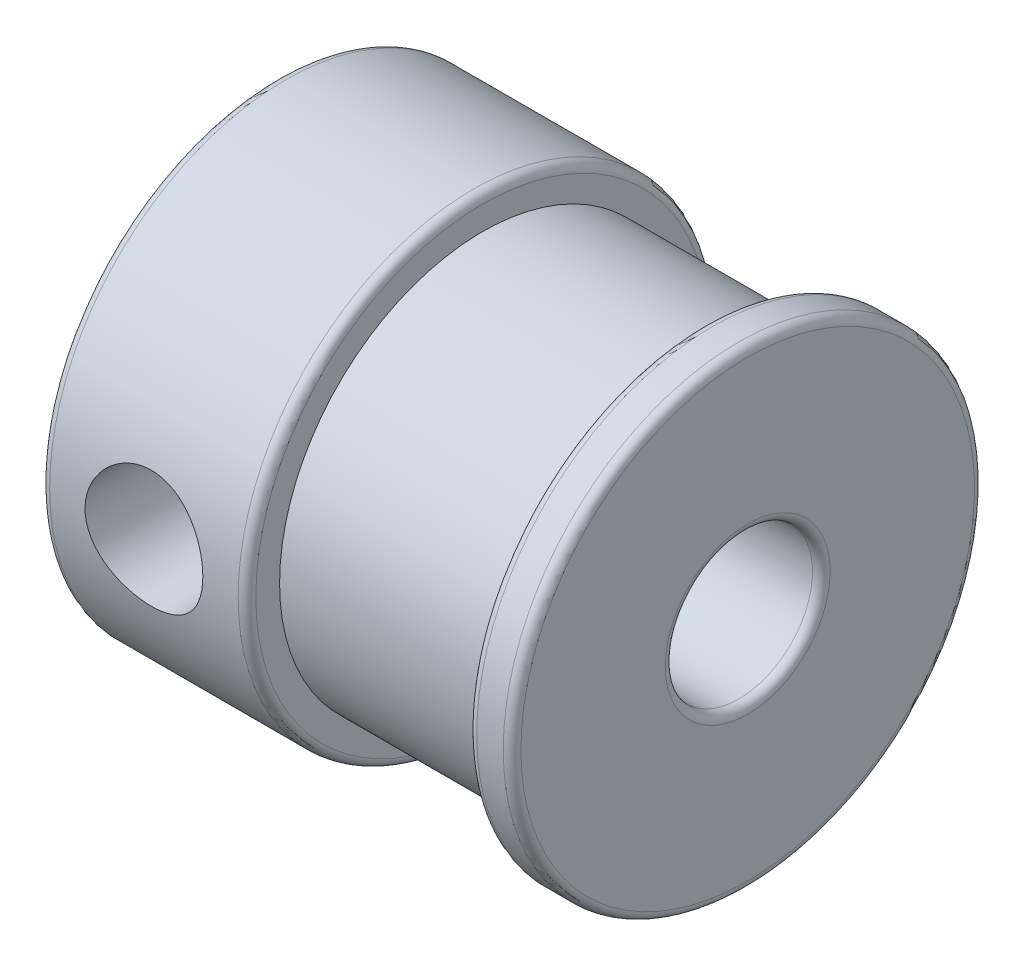
ISO-10303-21;
HEADER;
FILE_DESCRIPTION(('STEP AP214'),'2;1');
FILE_NAME('part.step','',(''),(''),'','','');
FILE_SCHEMA(('AUTOMOTIVE_DESIGN { 1 0 10303 214 1 1 1 1 }'));
ENDSEC;
DATA;
#1=APPLICATION_CONTEXT('core data for automotive mechanical design processes');
#2=APPLICATION_PROTOCOL_DEFINITION('international standard','automotive_design',2000,#1);
#3=PRODUCT_CONTEXT('',#1,'mechanical');
#4=PRODUCT('Part','Part','',(#3));
#5=PRODUCT_RELATED_PRODUCT_CATEGORY('part','',(#4));
#6=PRODUCT_DEFINITION_FORMATION('','',#4);
#7=PRODUCT_DEFINITION_CONTEXT('part definition',#1,'design');
#8=PRODUCT_DEFINITION('design','',#6,#7);
#9=PRODUCT_DEFINITION_SHAPE('','',#8);
#10=(LENGTH_UNIT() NAMED_UNIT(*) SI_UNIT(.MILLI.,.METRE.));
#11=(NAMED_UNIT(*) PLANE_ANGLE_UNIT() SI_UNIT($,.RADIAN.));
#12=(NAMED_UNIT(*) SI_UNIT($,.STERADIAN.) SOLID_ANGLE_UNIT());
#13=UNCERTAINTY_MEASURE_WITH_UNIT(LENGTH_MEASURE(1.E-05),#10,'distance_accuracy_value','');
#14=(GEOMETRIC_REPRESENTATION_CONTEXT(3) GLOBAL_UNCERTAINTY_ASSIGNED_CONTEXT((#13)) GLOBAL_UNIT_ASSIGNED_CONTEXT((#10,
#11,#12)) REPRESENTATION_CONTEXT('',''));
#15=CARTESIAN_POINT('',(0.,0.,0.));
#16=DIRECTION('',(0.,0.,1.));
#17=DIRECTION('',(1.,0.,0.));
#18=AXIS2_PLACEMENT_3D('',#15,#16,#17);
#19=CARTESIAN_POINT('',(0.,0.,0.));
#20=DIRECTION('',(-1.,0.,0.));
#21=DIRECTION('',(0.,0.,1.));
#22=AXIS2_PLACEMENT_3D('',#19,#20,#21);
#23=CYLINDRICAL_SURFACE('',#22,2.5);
#24=CARTESIAN_POINT('',(5.5,0.,2.5));
#25=CARTESIAN_POINT('',(5.49999242056707,0.0959968964388692,2.49999264947401));
#26=CARTESIAN_POINT('',(5.49303057133644,0.192133192964674,2.49441368411908));
#27=CARTESIAN_POINT('',(5.46565005995827,0.381319365477407,2.47259269360604));
#28=CARTESIAN_POINT('',(5.44520162873807,0.474361934321336,2.45632708000382));
#29=CARTESIAN_POINT('',(5.39232172110493,0.654094916824507,2.4146672181517));
#30=CARTESIAN_POINT('',(5.35996664856862,0.740821698128048,2.38933120144167));
#31=CARTESIAN_POINT('',(5.28488265652266,0.906926323692544,2.33136010996601));
#32=CARTESIAN_POINT('',(5.24215370414941,0.986304144671505,2.29872501207752));
#33=CARTESIAN_POINT('',(5.13137163496894,1.16318123656703,2.21575664728952));
#34=CARTESIAN_POINT('',(5.05968108482594,1.25736767952115,2.16321748603216));
#35=CARTESIAN_POINT('',(4.9027219342605,1.43041367827883,2.05292192603027));
#36=CARTESIAN_POINT('',(4.81741424649663,1.50922761533154,1.99515072200505));
#37=CARTESIAN_POINT('',(4.63322601592733,1.6521591895554,1.87856001629835));
#38=CARTESIAN_POINT('',(4.53415322702388,1.71602638457222,1.81973830902028));
#39=CARTESIAN_POINT('',(4.32346121749581,1.82646834413604,1.7088210988299));
#40=CARTESIAN_POINT('',(4.21188566611201,1.87310099386401,1.65670347089169));
#41=CARTESIAN_POINT('',(4.02612104832302,1.93086043771819,1.58835652300928));
#42=CARTESIAN_POINT('',(3.95618826201971,1.94865475820658,1.56628727770189));
#43=CARTESIAN_POINT('',(3.81278731587953,1.97673396798331,1.53069889155832));
#44=CARTESIAN_POINT('',(3.739328326475,1.98703731881776,1.5171587417974));
#45=CARTESIAN_POINT('',(3.58980748112896,1.99939840142554,1.50084234061103));
#46=CARTESIAN_POINT('',(3.5137285151792,2.00138345613423,1.49816096926556));
#47=CARTESIAN_POINT('',(3.36229510796726,1.99669481699685,1.50439962302809));
#48=CARTESIAN_POINT('',(3.2869413342337,1.99001379511087,1.51332946660241));
#49=CARTESIAN_POINT('',(3.12777769738727,1.9669530271194,1.5432072129997));
#50=CARTESIAN_POINT('',(3.044491993946,1.94921808205621,1.56581842049528));
#51=CARTESIAN_POINT('',(2.88346444046296,1.90444547348848,1.61997459936279));
#52=CARTESIAN_POINT('',(2.80573984346018,1.87738025642251,1.65154598198641));
#53=CARTESIAN_POINT('',(2.61933789395902,1.79974102194077,1.73656116159416));
#54=CARTESIAN_POINT('',(2.51419730169581,1.74414886595503,1.79313372968154));
#55=CARTESIAN_POINT('',(2.31628332220066,1.61638467497537,1.90913780060687));
#56=CARTESIAN_POINT('',(2.22352827915646,1.54418846902464,1.96857337048937));
#57=CARTESIAN_POINT('',(2.04872522859492,1.38145818326396,2.08612751968448));
#58=CARTESIAN_POINT('',(1.96702807769423,1.29048701026967,2.14416889260779));
#59=CARTESIAN_POINT('',(1.81990050056569,1.09198491072666,2.25171871494995));
#60=CARTESIAN_POINT('',(1.75442648388277,0.984499645201077,2.30124991822451));
#61=CARTESIAN_POINT('',(1.6594371525901,0.787777814380557,2.37424585643318));
#62=CARTESIAN_POINT('',(1.62499549556093,0.702177727329204,2.40111071224172));
#63=CARTESIAN_POINT('',(1.56787354901203,0.524913923737151,2.44597564111417));
#64=CARTESIAN_POINT('',(1.54518439505452,0.433254836272282,2.46398239496913));
#65=CARTESIAN_POINT('',(1.51286145306421,0.245713233844926,2.48970335685206));
#66=CARTESIAN_POINT('',(1.50329587525504,0.149811307212615,2.49736378633667));
#67=CARTESIAN_POINT('',(1.49814095102371,-0.0426080028675194,2.50148682701864));
#68=CARTESIAN_POINT('',(1.50254900117794,-0.139125268327964,2.49795152409062));
#69=CARTESIAN_POINT('',(1.52408281624768,-0.321746674155464,2.48076858642945));
#70=CARTESIAN_POINT('',(1.54014917513901,-0.408060891756567,2.46796352405063));
#71=CARTESIAN_POINT('',(1.58287218110156,-0.576335674228723,2.43417513213473));
#72=CARTESIAN_POINT('',(1.60953197109662,-0.658294938856942,2.41318937553439));
#73=CARTESIAN_POINT('',(1.67415037178393,-0.821235877548911,2.36289849431328));
#74=CARTESIAN_POINT('',(1.71270578595636,-0.901843619419055,2.33315912736867));
#75=CARTESIAN_POINT('',(1.79886215163279,-1.05541000448331,2.2678362272214));
#76=CARTESIAN_POINT('',(1.84646355423455,-1.12836826593788,2.23225240258423));
#77=CARTESIAN_POINT('',(1.95922431829687,-1.27925237569143,2.14993687522397));
#78=CARTESIAN_POINT('',(2.026001690483,-1.35550718978129,2.1023696976822));
#79=CARTESIAN_POINT('',(2.16938696137099,-1.4965368759753,2.0044349795202));
#80=CARTESIAN_POINT('',(2.24602283683883,-1.56127777727367,1.95405970991097));
#81=CARTESIAN_POINT('',(2.37643444323659,-1.65568487930787,1.87374135317135));
#82=CARTESIAN_POINT('',(2.42736059075333,-1.68913741792652,1.84354743685463));
#83=CARTESIAN_POINT('',(2.53262226142359,-1.75155001920544,1.78435415521131));
#84=CARTESIAN_POINT('',(2.58695957188079,-1.78050769868976,1.75535542951891));
#85=CARTESIAN_POINT('',(2.69887484028166,-1.83358089959817,1.69983828792997));
#86=CARTESIAN_POINT('',(2.75643976724369,-1.85771431687655,1.67331090774834));
#87=CARTESIAN_POINT('',(2.87500897850399,-1.90088481958635,1.62410209867689));
#88=CARTESIAN_POINT('',(2.93601073751954,-1.9199255893155,1.60141789380427));
#89=CARTESIAN_POINT('',(3.0660867242378,-1.95360165889083,1.5601942022258));
#90=CARTESIAN_POINT('',(3.13542266494035,-1.96779559724999,1.54209716714775));
#91=CARTESIAN_POINT('',(3.27683761273806,-1.98878905619367,1.51493371593791));
#92=CARTESIAN_POINT('',(3.34890922045049,-1.99560723074758,1.50584452307525));
#93=CARTESIAN_POINT('',(3.49434870546408,-2.00132058716546,1.49824736779721));
#94=CARTESIAN_POINT('',(3.56772145415416,-2.0001731977979,1.49979625918437));
#95=CARTESIAN_POINT('',(3.71298419302311,-1.98996519544204,1.51330771695992));
#96=CARTESIAN_POINT('',(3.7848716473261,-1.98089203653787,1.52528679347387));
#97=CARTESIAN_POINT('',(3.94460677434456,-1.95207745752715,1.56207076756083));
#98=CARTESIAN_POINT('',(4.03142308249112,-1.93009230408642,1.5894925841937));
#99=CARTESIAN_POINT('',(4.19863347868964,-1.87608177217432,1.65288907642407));
#100=CARTESIAN_POINT('',(4.27900776003672,-1.84402681542564,1.68888887211293));
#101=CARTESIAN_POINT('',(4.41217772204616,-1.78094746311468,1.75491158724439));
#102=CARTESIAN_POINT('',(4.46651918151829,-1.75202363190409,1.78388907325008));
#103=CARTESIAN_POINT('',(4.57183822981726,-1.68964733782463,1.84307948739002));
#104=CARTESIAN_POINT('',(4.62281458495115,-1.65619322765903,1.87329286211509));
#105=CARTESIAN_POINT('',(4.77077940329882,-1.54918435570711,1.9643799775812));
#106=CARTESIAN_POINT('',(4.86279868666248,-1.46898541640509,2.02569808481402));
#107=CARTESIAN_POINT('',(5.03338946483077,-1.29001718858431,2.14418278787113));
#108=CARTESIAN_POINT('',(5.11177022423679,-1.19101966157648,2.20128491964101));
#109=CARTESIAN_POINT('',(5.21557672941679,-1.02998399899547,2.27874650804527));
#110=CARTESIAN_POINT('',(5.24786844413512,-0.974255400199692,2.30318868109329));
#111=CARTESIAN_POINT('',(5.30736810096139,-0.858854828628041,2.34866115465602));
#112=CARTESIAN_POINT('',(5.33457915448451,-0.799185299805359,2.36969354228912));
#113=CARTESIAN_POINT('',(5.39178005989561,-0.655037739424243,2.41420905511499));
#114=CARTESIAN_POINT('',(5.41948267180093,-0.569110239590115,2.43602892887628));
#115=CARTESIAN_POINT('',(5.46315767338771,-0.392713097427717,2.47058864976841));
#116=CARTESIAN_POINT('',(5.4791607887746,-0.302256024103133,2.48335227816872));
#117=CARTESIAN_POINT('',(5.49256302556031,-0.175880930919907,2.49405378309104));
#118=CARTESIAN_POINT('',(5.49534737874577,-0.140808552821268,2.4962791876343));
#119=CARTESIAN_POINT('',(5.49906746352746,-0.0704970748918255,2.499253810179));
#120=CARTESIAN_POINT('',(5.50000278378989,-0.0352579397117329,2.50000269971647));
#121=CARTESIAN_POINT('',(5.5,0.,2.5));
#122=B_SPLINE_CURVE_WITH_KNOTS('',3,(#24,#25,#26,#27,#28,#29,#30,#31,#32,#33,#34,#35,#36,#37,
#38,#39,#40,#41,#42,#43,#44,#45,#46,#47,#48,#49,#50,#51,#52,#53,#54,#55,#56,#57,#58,#59,#60,#61,
#62,#63,#64,#65,#66,#67,#68,#69,#70,#71,#72,#73,#74,#75,#76,#77,#78,#79,#80,#81,#82,#83,#84,#85,
#86,#87,#88,#89,#90,#91,#92,#93,#94,#95,#96,#97,#98,#99,#100,#101,#102,#103,#104,#105,#106,#107,
#108,#109,#110,#111,#112,#113,#114,#115,#116,#117,#118,#119,#120,#121),.UNSPECIFIED.,.T.,.F.,(4,
2,2,2,2,2,2,2,2,2,2,2,2,2,2,2,2,2,2,2,2,2,2,2,2,2,2,2,2,2,2,2,2,2,2,2,2,2,2,2,2,2,2,2,2,2,2,2,
4),(0.,0.287836605992209,0.576310692639343,0.862965057250605,1.14962032997081,1.53607888200101,
1.92366738187851,2.31734741765481,2.70969292925127,2.9353448634113,3.16043877408111,
3.38749528500759,3.61474392028823,3.87758630032011,4.14121163495706,4.53425748188301,
4.92787915886674,5.33198173288419,5.73498644040677,6.02213978124802,6.30907621738868,
6.59749843639965,6.88586692268771,7.15087004938159,7.41595185759573,7.69742753051566,
7.9789172435135,8.31365537249325,8.64936529970902,8.85316560745906,9.05707360380851,
9.26021055202079,9.46320013996582,9.68152133432596,9.89928907450684,10.1182215471168,
10.3375012031536,10.616933053181,10.8971934831173,11.1010640012511,11.3050088506911,
11.7129165318148,12.1261363563906,12.3324811048119,12.5386990694968,12.8161540735935,
13.0928777702216,13.1985714874516,13.3042887145431),.UNSPECIFIED.);
#123=CARTESIAN_POINT('',(5.5,0.,2.5));
#124=VERTEX_POINT('',#123);
#125=EDGE_CURVE('E90',#124,#124,#122,.T.);
#126=ORIENTED_EDGE('',*,*,#125,.T.);
#127=EDGE_LOOP('',(#126));
#128=FACE_BOUND('',#127,.T.);
#129=CARTESIAN_POINT('',(5.5,0.,-2.5));
#130=CARTESIAN_POINT('',(5.49999242056707,-0.0959968964388692,-2.49999264947401));
#131=CARTESIAN_POINT('',(5.49303057133644,-0.192133192964674,-2.49441368411908));
#132=CARTESIAN_POINT('',(5.46565005995827,-0.381319365477407,-2.47259269360604));
#133=CARTESIAN_POINT('',(5.44520162873807,-0.474361934321336,-2.45632708000382));
#134=CARTESIAN_POINT('',(5.39232172110493,-0.654094916824507,-2.4146672181517));
#135=CARTESIAN_POINT('',(5.35996664856862,-0.740821698128048,-2.38933120144167));
#136=CARTESIAN_POINT('',(5.28488265652266,-0.906926323692544,-2.33136010996601));
#137=CARTESIAN_POINT('',(5.24215370414941,-0.986304144671505,-2.29872501207752));
#138=CARTESIAN_POINT('',(5.13137163496894,-1.16318123656703,-2.21575664728952));
#139=CARTESIAN_POINT('',(5.05968108482594,-1.25736767952115,-2.16321748603216));
#140=CARTESIAN_POINT('',(4.9027219342605,-1.43041367827883,-2.05292192603027));
#141=CARTESIAN_POINT('',(4.81741424649663,-1.50922761533154,-1.99515072200505));
#142=CARTESIAN_POINT('',(4.63322601592733,-1.6521591895554,-1.87856001629835));
#143=CARTESIAN_POINT('',(4.53415322702388,-1.71602638457222,-1.81973830902028));
#144=CARTESIAN_POINT('',(4.32346121749581,-1.82646834413604,-1.7088210988299));
#145=CARTESIAN_POINT('',(4.21188566611201,-1.87310099386401,-1.65670347089169));
#146=CARTESIAN_POINT('',(4.02612104832302,-1.93086043771819,-1.58835652300928));
#147=CARTESIAN_POINT('',(3.95618826201971,-1.94865475820658,-1.56628727770189));
#148=CARTESIAN_POINT('',(3.81278731587953,-1.97673396798331,-1.53069889155832));
#149=CARTESIAN_POINT('',(3.739328326475,-1.98703731881776,-1.5171587417974));
#150=CARTESIAN_POINT('',(3.58980748112896,-1.99939840142554,-1.50084234061103));
#151=CARTESIAN_POINT('',(3.5137285151792,-2.00138345613423,-1.49816096926556));
#152=CARTESIAN_POINT('',(3.36229510796726,-1.99669481699685,-1.50439962302809));
#153=CARTESIAN_POINT('',(3.2869413342337,-1.99001379511087,-1.51332946660241));
#154=CARTESIAN_POINT('',(3.12777769738727,-1.9669530271194,-1.5432072129997));
#155=CARTESIAN_POINT('',(3.044491993946,-1.94921808205621,-1.56581842049528));
#156=CARTESIAN_POINT('',(2.88346444046296,-1.90444547348848,-1.61997459936279));
#157=CARTESIAN_POINT('',(2.80573984346018,-1.87738025642251,-1.65154598198641));
#158=CARTESIAN_POINT('',(2.61933789395902,-1.79974102194077,-1.73656116159416));
#159=CARTESIAN_POINT('',(2.51419730169581,-1.74414886595503,-1.79313372968154));
#160=CARTESIAN_POINT('',(2.31628332220066,-1.61638467497537,-1.90913780060687));
#161=CARTESIAN_POINT('',(2.22352827915646,-1.54418846902464,-1.96857337048937));
#162=CARTESIAN_POINT('',(2.04872522859492,-1.38145818326396,-2.08612751968448));
#163=CARTESIAN_POINT('',(1.96702807769423,-1.29048701026967,-2.14416889260779));
#164=CARTESIAN_POINT('',(1.81990050056569,-1.09198491072666,-2.25171871494995));
#165=CARTESIAN_POINT('',(1.75442648388277,-0.984499645201077,-2.30124991822451));
#166=CARTESIAN_POINT('',(1.6594371525901,-0.787777814380557,-2.37424585643318));
#167=CARTESIAN_POINT('',(1.62499549556093,-0.702177727329204,-2.40111071224172));
#168=CARTESIAN_POINT('',(1.56787354901203,-0.524913923737151,-2.44597564111417));
#169=CARTESIAN_POINT('',(1.54518439505452,-0.433254836272282,-2.46398239496913));
#170=CARTESIAN_POINT('',(1.51286145306421,-0.245713233844926,-2.48970335685206));
#171=CARTESIAN_POINT('',(1.50329587525504,-0.149811307212615,-2.49736378633667));
#172=CARTESIAN_POINT('',(1.49814095102371,0.0426080028675194,-2.50148682701864));
#173=CARTESIAN_POINT('',(1.50254900117794,0.139125268327964,-2.49795152409062));
#174=CARTESIAN_POINT('',(1.52408281624768,0.321746674155464,-2.48076858642945));
#175=CARTESIAN_POINT('',(1.54014917513901,0.408060891756567,-2.46796352405063));
#176=CARTESIAN_POINT('',(1.58287218110156,0.576335674228723,-2.43417513213473));
#177=CARTESIAN_POINT('',(1.60953197109662,0.658294938856942,-2.41318937553439));
#178=CARTESIAN_POINT('',(1.67415037178393,0.821235877548911,-2.36289849431328));
#179=CARTESIAN_POINT('',(1.71270578595636,0.901843619419055,-2.33315912736867));
#180=CARTESIAN_POINT('',(1.79886215163279,1.05541000448331,-2.2678362272214));
#181=CARTESIAN_POINT('',(1.84646355423455,1.12836826593788,-2.23225240258423));
#182=CARTESIAN_POINT('',(1.95922431829687,1.27925237569143,-2.14993687522397));
#183=CARTESIAN_POINT('',(2.026001690483,1.35550718978129,-2.1023696976822));
#184=CARTESIAN_POINT('',(2.16938696137099,1.4965368759753,-2.0044349795202));
#185=CARTESIAN_POINT('',(2.24602283683883,1.56127777727367,-1.95405970991097));
#186=CARTESIAN_POINT('',(2.37643444323659,1.65568487930787,-1.87374135317135));
#187=CARTESIAN_POINT('',(2.42736059075333,1.68913741792652,-1.84354743685463));
#188=CARTESIAN_POINT('',(2.53262226142359,1.75155001920544,-1.78435415521131));
#189=CARTESIAN_POINT('',(2.58695957188079,1.78050769868976,-1.75535542951891));
#190=CARTESIAN_POINT('',(2.69887484028166,1.83358089959817,-1.69983828792997));
#191=CARTESIAN_POINT('',(2.75643976724369,1.85771431687655,-1.67331090774834));
#192=CARTESIAN_POINT('',(2.87500897850399,1.90088481958635,-1.62410209867689));
#193=CARTESIAN_POINT('',(2.93601073751954,1.9199255893155,-1.60141789380427));
#194=CARTESIAN_POINT('',(3.0660867242378,1.95360165889083,-1.5601942022258));
#195=CARTESIAN_POINT('',(3.13542266494035,1.96779559724999,-1.54209716714775));
#196=CARTESIAN_POINT('',(3.27683761273806,1.98878905619367,-1.51493371593791));
#197=CARTESIAN_POINT('',(3.34890922045049,1.99560723074758,-1.50584452307525));
#198=CARTESIAN_POINT('',(3.49434870546408,2.00132058716546,-1.49824736779721));
#199=CARTESIAN_POINT('',(3.56772145415416,2.0001731977979,-1.49979625918437));
#200=CARTESIAN_POINT('',(3.71298419302311,1.98996519544204,-1.51330771695992));
#201=CARTESIAN_POINT('',(3.7848716473261,1.98089203653787,-1.52528679347387));
#202=CARTESIAN_POINT('',(3.94460677434456,1.95207745752715,-1.56207076756083));
#203=CARTESIAN_POINT('',(4.03142308249112,1.93009230408642,-1.5894925841937));
#204=CARTESIAN_POINT('',(4.19863347868964,1.87608177217432,-1.65288907642407));
#205=CARTESIAN_POINT('',(4.27900776003672,1.84402681542564,-1.68888887211293));
#206=CARTESIAN_POINT('',(4.41217772204616,1.78094746311468,-1.75491158724439));
#207=CARTESIAN_POINT('',(4.46651918151829,1.75202363190409,-1.78388907325008));
#208=CARTESIAN_POINT('',(4.57183822981726,1.68964733782463,-1.84307948739002));
#209=CARTESIAN_POINT('',(4.62281458495115,1.65619322765903,-1.87329286211509));
#210=CARTESIAN_POINT('',(4.77077940329882,1.54918435570711,-1.9643799775812));
#211=CARTESIAN_POINT('',(4.86279868666248,1.46898541640509,-2.02569808481402));
#212=CARTESIAN_POINT('',(5.03338946483077,1.29001718858431,-2.14418278787113));
#213=CARTESIAN_POINT('',(5.11177022423679,1.19101966157648,-2.20128491964101));
#214=CARTESIAN_POINT('',(5.21557672941679,1.02998399899547,-2.27874650804527));
#215=CARTESIAN_POINT('',(5.24786844413512,0.974255400199692,-2.30318868109329));
#216=CARTESIAN_POINT('',(5.30736810096139,0.858854828628041,-2.34866115465602));
#217=CARTESIAN_POINT('',(5.33457915448451,0.799185299805359,-2.36969354228912));
#218=CARTESIAN_POINT('',(5.39178005989561,0.655037739424243,-2.41420905511499));
#219=CARTESIAN_POINT('',(5.41948267180093,0.569110239590115,-2.43602892887628));
#220=CARTESIAN_POINT('',(5.46315767338771,0.392713097427717,-2.47058864976841));
#221=CARTESIAN_POINT('',(5.4791607887746,0.302256024103133,-2.48335227816872));
#222=CARTESIAN_POINT('',(5.49256302556031,0.175880930919907,-2.49405378309104));
#223=CARTESIAN_POINT('',(5.49534737874577,0.140808552821268,-2.4962791876343));
#224=CARTESIAN_POINT('',(5.49906746352746,0.0704970748918255,-2.499253810179));
#225=CARTESIAN_POINT('',(5.50000278378989,0.0352579397117329,-2.50000269971647));
#226=CARTESIAN_POINT('',(5.5,0.,-2.5));
#227=B_SPLINE_CURVE_WITH_KNOTS('',3,(#129,#130,#131,#132,#133,#134,#135,#136,#137,#138,#139,
#140,#141,#142,#143,#144,#145,#146,#147,#148,#149,#150,#151,#152,#153,#154,#155,#156,#157,#158,
#159,#160,#161,#162,#163,#164,#165,#166,#167,#168,#169,#170,#171,#172,#173,#174,#175,#176,#177,
#178,#179,#180,#181,#182,#183,#184,#185,#186,#187,#188,#189,#190,#191,#192,#193,#194,#195,#196,
#197,#198,#199,#200,#201,#202,#203,#204,#205,#206,#207,#208,#209,#210,#211,#212,#213,#214,#215,
#216,#217,#218,#219,#220,#221,#222,#223,#224,#225,#226),.UNSPECIFIED.,.T.,.F.,(4,2,2,2,2,2,2,2,
2,2,2,2,2,2,2,2,2,2,2,2,2,2,2,2,2,2,2,2,2,2,2,2,2,2,2,2,2,2,2,2,2,2,2,2,2,2,2,2,4),(0.,
0.287836605992209,0.576310692639343,0.862965057250605,1.14962032997081,1.53607888200101,
1.92366738187851,2.31734741765481,2.70969292925127,2.9353448634113,3.16043877408111,
3.38749528500759,3.61474392028823,3.87758630032011,4.14121163495706,4.53425748188301,
4.92787915886674,5.33198173288419,5.73498644040677,6.02213978124802,6.30907621738868,
6.59749843639965,6.88586692268771,7.15087004938159,7.41595185759573,7.69742753051566,
7.9789172435135,8.31365537249325,8.64936529970902,8.85316560745906,9.05707360380851,
9.26021055202079,9.46320013996582,9.68152133432596,9.89928907450684,10.1182215471168,
10.3375012031536,10.616933053181,10.8971934831173,11.1010640012511,11.3050088506911,
11.7129165318148,12.1261363563906,12.3324811048119,12.5386990694968,12.8161540735935,
13.0928777702216,13.1985714874516,13.3042887145431),.UNSPECIFIED.);
#228=CARTESIAN_POINT('',(5.5,0.,-2.5));
#229=VERTEX_POINT('',#228);
#230=EDGE_CURVE('E83',#229,#229,#227,.T.);
#231=ORIENTED_EDGE('',*,*,#230,.T.);
#232=EDGE_LOOP('',(#231));
#233=FACE_BOUND('',#232,.T.);
#234=CARTESIAN_POINT('',(0.3,0.,0.));
#235=DIRECTION('',(1.,0.,0.));
#236=DIRECTION('',(0.,0.,-1.));
#237=AXIS2_PLACEMENT_3D('',#234,#235,#236);
#238=CIRCLE('',#237,2.5);
#239=CARTESIAN_POINT('',(0.3,0.,-2.5));
#240=VERTEX_POINT('',#239);
#241=EDGE_CURVE('E162',#240,#240,#238,.F.);
#242=ORIENTED_EDGE('',*,*,#241,.T.);
#243=EDGE_LOOP('',(#242));
#244=FACE_BOUND('',#243,.T.);
#245=CARTESIAN_POINT('',(15.7,0.,0.));
#246=DIRECTION('',(-1.,0.,0.));
#247=DIRECTION('',(0.,0.,1.));
#248=AXIS2_PLACEMENT_3D('',#245,#246,#247);
#249=CIRCLE('',#248,2.5);
#250=CARTESIAN_POINT('',(15.7,0.,2.5));
#251=VERTEX_POINT('',#250);
#252=EDGE_CURVE('E166',#251,#251,#249,.F.);
#253=ORIENTED_EDGE('',*,*,#252,.T.);
#254=EDGE_LOOP('',(#253));
#255=FACE_BOUND('',#254,.T.);
#256=ADVANCED_FACE('F37',(#128,#233,#244,#255),#23,.F.);
#257=CARTESIAN_POINT('',(0.,0.,-2.5));
#258=DIRECTION('',(1.,0.,0.));
#259=DIRECTION('',(0.,0.,-1.));
#260=AXIS2_PLACEMENT_3D('',#257,#258,#259);
#261=PLANE('',#260);
#262=CARTESIAN_POINT('',(0.,0.,0.));
#263=DIRECTION('',(1.,0.,0.));
#264=DIRECTION('',(0.,0.,-1.));
#265=AXIS2_PLACEMENT_3D('',#262,#263,#264);
#266=CIRCLE('',#265,2.8);
#267=CARTESIAN_POINT('',(0.,0.,-2.8));
#268=VERTEX_POINT('',#267);
#269=EDGE_CURVE('E154',#268,#268,#266,.T.);
#270=ORIENTED_EDGE('',*,*,#269,.T.);
#271=EDGE_LOOP('',(#270));
#272=FACE_BOUND('',#271,.T.);
#273=CARTESIAN_POINT('',(0.,0.,0.));
#274=DIRECTION('',(1.,0.,0.));
#275=DIRECTION('',(0.,0.,-1.));
#276=AXIS2_PLACEMENT_3D('',#273,#274,#275);
#277=CIRCLE('',#276,7.7);
#278=CARTESIAN_POINT('',(0.,0.,-7.7));
#279=VERTEX_POINT('',#278);
#280=EDGE_CURVE('E158',#279,#279,#277,.F.);
#281=ORIENTED_EDGE('',*,*,#280,.T.);
#282=EDGE_LOOP('',(#281));
#283=FACE_BOUND('',#282,.T.);
#284=ADVANCED_FACE('F98',(#272,#283),#261,.F.);
#285=CARTESIAN_POINT('',(0.,0.,0.));
#286=DIRECTION('',(-1.,0.,0.));
#287=DIRECTION('',(0.,0.,1.));
#288=AXIS2_PLACEMENT_3D('',#285,#286,#287);
#289=CYLINDRICAL_SURFACE('',#288,8.);
#290=CARTESIAN_POINT('',(5.5,0.,-8.));
#291=CARTESIAN_POINT('',(5.49999689901579,0.110501451559641,-7.9999981315735));
#292=CARTESIAN_POINT('',(5.49081126563495,0.221037543774351,-7.99768770842435));
#293=CARTESIAN_POINT('',(5.45436646492399,0.438941765027377,-7.98869485106526));
#294=CARTESIAN_POINT('',(5.42709705394953,0.546308062494319,-7.98200993893301));
#295=CARTESIAN_POINT('',(5.35541432871722,0.754694496243436,-7.96500835109376));
#296=CARTESIAN_POINT('',(5.31102160171298,0.855722084573336,-7.95469603789411));
#297=CARTESIAN_POINT('',(5.20642481327354,1.04889617587257,-7.93153791743495));
#298=CARTESIAN_POINT('',(5.14622021850804,1.14104237913168,-7.91869202472209));
#299=CARTESIAN_POINT('',(5.01039894712776,1.31573590306789,-7.89156551455591));
#300=CARTESIAN_POINT('',(4.93451790005459,1.39807425341474,-7.87726276197502));
#301=CARTESIAN_POINT('',(4.77006372678795,1.54899856960443,-7.84898160157248));
#302=CARTESIAN_POINT('',(4.68148916940409,1.61758298259892,-7.83500323053157));
#303=CARTESIAN_POINT('',(4.49253969768401,1.74003539039863,-7.80873034264225));
#304=CARTESIAN_POINT('',(4.39200902558836,1.79366962123352,-7.79646392619748));
#305=CARTESIAN_POINT('',(4.18300211778662,1.88319587806766,-7.77532659757355));
#306=CARTESIAN_POINT('',(4.07452715555731,1.91909074058685,-7.76645514259225));
#307=CARTESIAN_POINT('',(3.85500866906445,1.97140644907302,-7.7533396892843));
#308=CARTESIAN_POINT('',(3.74406013861601,1.98820302444274,-7.74900654662681));
#309=CARTESIAN_POINT('',(3.52084190800087,2.00301570008854,-7.74519149946122));
#310=CARTESIAN_POINT('',(3.40857242574382,2.00103485575748,-7.74570880570571));
#311=CARTESIAN_POINT('',(3.1887789230062,1.97864869951961,-7.75145607355756));
#312=CARTESIAN_POINT('',(3.08120583804623,1.95869112025418,-7.75657150676391));
#313=CARTESIAN_POINT('',(2.87098526545192,1.90163224920399,-7.77075612894758));
#314=CARTESIAN_POINT('',(2.76833812929477,1.86452973609252,-7.77982559958985));
#315=CARTESIAN_POINT('',(2.56968264499716,1.77385263724958,-7.80100151874212));
#316=CARTESIAN_POINT('',(2.47375177094724,1.72011555631056,-7.81313769959755));
#317=CARTESIAN_POINT('',(2.29210838699091,1.59780836801993,-7.83906281127988));
#318=CARTESIAN_POINT('',(2.20639766924367,1.52923566507845,-7.85285203112837));
#319=CARTESIAN_POINT('',(2.04506184574079,1.37688456624163,-7.88101174053188));
#320=CARTESIAN_POINT('',(1.96979401325153,1.29272834422115,-7.89538759304001));
#321=CARTESIAN_POINT('',(1.8343716767148,1.11281589000493,-7.92274620771675));
#322=CARTESIAN_POINT('',(1.77421763431525,1.01705930361059,-7.93572892732543));
#323=CARTESIAN_POINT('',(1.67059921836749,0.816154518241856,-7.9589030945892));
#324=CARTESIAN_POINT('',(1.62719287966076,0.710975190944832,-7.96908480170303));
#325=CARTESIAN_POINT('',(1.55877692572057,0.494501344190511,-7.98543889321888));
#326=CARTESIAN_POINT('',(1.53376379144248,0.383207998867313,-7.99161204452374));
#327=CARTESIAN_POINT('',(1.50338991258822,0.160719960520036,-7.999139990285));
#328=CARTESIAN_POINT('',(1.4975426318996,0.0495956266509467,-8.00061404677705));
#329=CARTESIAN_POINT('',(1.50433200274065,-0.172043833068677,-7.99891739752601));
#330=CARTESIAN_POINT('',(1.51696699039884,-0.28255901285946,-7.99574710989128));
#331=CARTESIAN_POINT('',(1.55996121118851,-0.498152358368655,-7.98519441503143));
#332=CARTESIAN_POINT('',(1.59005501796932,-0.603286825291672,-7.97787512247748));
#333=CARTESIAN_POINT('',(1.66680944537126,-0.807009723270015,-7.95984942178845));
#334=CARTESIAN_POINT('',(1.71347173908423,-0.905597492043513,-7.94914267159856));
#335=CARTESIAN_POINT('',(1.8229815051663,-1.0953641792398,-7.92524410568414));
#336=CARTESIAN_POINT('',(1.88610148319568,-1.18638058911444,-7.91201156489243));
#337=CARTESIAN_POINT('',(2.02638654506263,-1.35670215152433,-7.88459345583226));
#338=CARTESIAN_POINT('',(2.10355405282254,-1.43600527863068,-7.87040772335606));
#339=CARTESIAN_POINT('',(2.27200261445929,-1.58265409076364,-7.84225275947695));
#340=CARTESIAN_POINT('',(2.36358360400323,-1.64965849016271,-7.82829738916375));
#341=CARTESIAN_POINT('',(2.55697684595429,-1.7673476786836,-7.80257171169652));
#342=CARTESIAN_POINT('',(2.65878864394634,-1.81803319221058,-7.79080130756035));
#343=CARTESIAN_POINT('',(2.8692076298841,-1.90126856081239,-7.77090792979553));
#344=CARTESIAN_POINT('',(2.97777017112535,-1.93392586220542,-7.76276340389207));
#345=CARTESIAN_POINT('',(3.19907951718548,-1.98046087993837,-7.75102325453578));
#346=CARTESIAN_POINT('',(3.31182540137665,-1.99434270330488,-7.74742663626581));
#347=CARTESIAN_POINT('',(3.53482803180694,-2.00271812044533,-7.74526534938609));
#348=CARTESIAN_POINT('',(3.64506324683297,-1.99775719704016,-7.74655910304352));
#349=CARTESIAN_POINT('',(3.86307185155731,-1.96983637108382,-7.7537054534379));
#350=CARTESIAN_POINT('',(3.97084529068487,-1.94687683024903,-7.75955795855809));
#351=CARTESIAN_POINT('',(4.18027794542055,-1.88390842592373,-7.77508347576963));
#352=CARTESIAN_POINT('',(4.28196974032028,-1.84400187290717,-7.78473353648412));
#353=CARTESIAN_POINT('',(4.47728717695159,-1.74835321814009,-7.80677007633105));
#354=CARTESIAN_POINT('',(4.57091169758255,-1.69260892004559,-7.81915693494364));
#355=CARTESIAN_POINT('',(4.75007283866936,-1.56515699818285,-7.84567512351349));
#356=CARTESIAN_POINT('',(4.83533476456528,-1.49307088388301,-7.85984353109009));
#357=CARTESIAN_POINT('',(4.99272939306054,-1.33571916158631,-7.88810702995048));
#358=CARTESIAN_POINT('',(5.06485897348396,-1.25045042834819,-7.90220210302746));
#359=CARTESIAN_POINT('',(5.19521507808614,-1.06729011560345,-7.92903540863551));
#360=CARTESIAN_POINT('',(5.25316615156211,-0.969197896421849,-7.94174444487824));
#361=CARTESIAN_POINT('',(5.35166328392071,-0.764354746013968,-7.96406566633491));
#362=CARTESIAN_POINT('',(5.39222181419805,-0.657610084582319,-7.97368006933042));
#363=CARTESIAN_POINT('',(5.44876244043954,-0.459213670991296,-7.98730746087389));
#364=CARTESIAN_POINT('',(5.46793499073791,-0.368506894544092,-7.9920344673692));
#365=CARTESIAN_POINT('',(5.49355459149592,-0.185208095381711,-7.99838140309264));
#366=CARTESIAN_POINT('',(5.50000259907374,-0.0926162149901553,-8.00000156601192));
#367=CARTESIAN_POINT('',(5.5,0.,-8.));
#368=B_SPLINE_CURVE_WITH_KNOTS('',3,(#290,#291,#292,#293,#294,#295,#296,#297,#298,#299,#300,
#301,#302,#303,#304,#305,#306,#307,#308,#309,#310,#311,#312,#313,#314,#315,#316,#317,#318,#319,
#320,#321,#322,#323,#324,#325,#326,#327,#328,#329,#330,#331,#332,#333,#334,#335,#336,#337,#338,
#339,#340,#341,#342,#343,#344,#345,#346,#347,#348,#349,#350,#351,#352,#353,#354,#355,#356,#357,
#358,#359,#360,#361,#362,#363,#364,#365,#366,#367),.UNSPECIFIED.,.T.,.F.,(4,2,2,2,2,2,2,2,2,2,2,
2,2,2,2,2,2,2,2,2,2,2,2,2,2,2,2,2,2,2,2,2,2,2,2,2,2,2,4),(0.,0.33116494996252,0.662517650351866,
0.993473203048141,1.32443992022577,1.66152580582852,1.99864972773416,2.34078196727743,
2.68285948225825,3.01808393468093,3.3532538415469,3.68029996013785,4.00736937959146,
4.337740371696,4.66816921119311,5.00802001296453,5.34788119415424,5.6889097201658,
6.02987298255951,6.36211078603463,6.69431868154751,7.02160366023144,7.34892169767481,
7.68204783424897,8.01523150681786,8.35659345610396,8.69794025003772,9.03723006156476,
9.37644564340971,9.70591707202578,10.0353818794581,10.3628853408369,10.6904342418696,
11.0265276855097,11.3627009303165,11.7049624733721,12.0469781843289,12.3245632392729,
12.6021274139515),.UNSPECIFIED.);
#369=CARTESIAN_POINT('',(5.5,0.,-8.));
#370=VERTEX_POINT('',#369);
#371=EDGE_CURVE('E10',#370,#370,#368,.T.);
#372=ORIENTED_EDGE('',*,*,#371,.T.);
#373=EDGE_LOOP('',(#372));
#374=FACE_BOUND('',#373,.T.);
#375=CARTESIAN_POINT('',(5.5,0.,8.));
#376=CARTESIAN_POINT('',(5.49999689901579,-0.110501451559641,7.9999981315735));
#377=CARTESIAN_POINT('',(5.49081126563495,-0.221037543774351,7.99768770842435));
#378=CARTESIAN_POINT('',(5.45436646492399,-0.438941765027377,7.98869485106526));
#379=CARTESIAN_POINT('',(5.42709705394953,-0.546308062494319,7.98200993893301));
#380=CARTESIAN_POINT('',(5.35541432871722,-0.754694496243436,7.96500835109376));
#381=CARTESIAN_POINT('',(5.31102160171298,-0.855722084573336,7.95469603789411));
#382=CARTESIAN_POINT('',(5.20642481327354,-1.04889617587257,7.93153791743495));
#383=CARTESIAN_POINT('',(5.14622021850804,-1.14104237913168,7.91869202472209));
#384=CARTESIAN_POINT('',(5.01039894712776,-1.31573590306789,7.89156551455591));
#385=CARTESIAN_POINT('',(4.93451790005459,-1.39807425341474,7.87726276197502));
#386=CARTESIAN_POINT('',(4.77006372678795,-1.54899856960443,7.84898160157248));
#387=CARTESIAN_POINT('',(4.68148916940409,-1.61758298259892,7.83500323053157));
#388=CARTESIAN_POINT('',(4.49253969768401,-1.74003539039863,7.80873034264225));
#389=CARTESIAN_POINT('',(4.39200902558836,-1.79366962123352,7.79646392619748));
#390=CARTESIAN_POINT('',(4.18300211778662,-1.88319587806766,7.77532659757355));
#391=CARTESIAN_POINT('',(4.07452715555731,-1.91909074058685,7.76645514259225));
#392=CARTESIAN_POINT('',(3.85500866906445,-1.97140644907302,7.7533396892843));
#393=CARTESIAN_POINT('',(3.74406013861601,-1.98820302444274,7.74900654662681));
#394=CARTESIAN_POINT('',(3.52084190800087,-2.00301570008854,7.74519149946122));
#395=CARTESIAN_POINT('',(3.40857242574382,-2.00103485575748,7.74570880570571));
#396=CARTESIAN_POINT('',(3.1887789230062,-1.97864869951961,7.75145607355756));
#397=CARTESIAN_POINT('',(3.08120583804623,-1.95869112025418,7.75657150676391));
#398=CARTESIAN_POINT('',(2.87098526545192,-1.90163224920399,7.77075612894758));
#399=CARTESIAN_POINT('',(2.76833812929477,-1.86452973609252,7.77982559958985));
#400=CARTESIAN_POINT('',(2.56968264499716,-1.77385263724958,7.80100151874212));
#401=CARTESIAN_POINT('',(2.47375177094724,-1.72011555631056,7.81313769959755));
#402=CARTESIAN_POINT('',(2.29210838699091,-1.59780836801993,7.83906281127988));
#403=CARTESIAN_POINT('',(2.20639766924367,-1.52923566507845,7.85285203112837));
#404=CARTESIAN_POINT('',(2.04506184574079,-1.37688456624163,7.88101174053188));
#405=CARTESIAN_POINT('',(1.96979401325153,-1.29272834422115,7.89538759304001));
#406=CARTESIAN_POINT('',(1.8343716767148,-1.11281589000493,7.92274620771675));
#407=CARTESIAN_POINT('',(1.77421763431525,-1.01705930361059,7.93572892732543));
#408=CARTESIAN_POINT('',(1.67059921836749,-0.816154518241856,7.9589030945892));
#409=CARTESIAN_POINT('',(1.62719287966076,-0.710975190944832,7.96908480170303));
#410=CARTESIAN_POINT('',(1.55877692572057,-0.494501344190511,7.98543889321888));
#411=CARTESIAN_POINT('',(1.53376379144248,-0.383207998867313,7.99161204452374));
#412=CARTESIAN_POINT('',(1.50338991258822,-0.160719960520036,7.999139990285));
#413=CARTESIAN_POINT('',(1.4975426318996,-0.0495956266509467,8.00061404677705));
#414=CARTESIAN_POINT('',(1.50433200274065,0.172043833068677,7.99891739752601));
#415=CARTESIAN_POINT('',(1.51696699039884,0.28255901285946,7.99574710989128));
#416=CARTESIAN_POINT('',(1.55996121118851,0.498152358368655,7.98519441503143));
#417=CARTESIAN_POINT('',(1.59005501796932,0.603286825291672,7.97787512247748));
#418=CARTESIAN_POINT('',(1.66680944537126,0.807009723270015,7.95984942178845));
#419=CARTESIAN_POINT('',(1.71347173908423,0.905597492043513,7.94914267159856));
#420=CARTESIAN_POINT('',(1.8229815051663,1.0953641792398,7.92524410568414));
#421=CARTESIAN_POINT('',(1.88610148319568,1.18638058911444,7.91201156489243));
#422=CARTESIAN_POINT('',(2.02638654506263,1.35670215152433,7.88459345583226));
#423=CARTESIAN_POINT('',(2.10355405282254,1.43600527863068,7.87040772335606));
#424=CARTESIAN_POINT('',(2.27200261445929,1.58265409076364,7.84225275947695));
#425=CARTESIAN_POINT('',(2.36358360400323,1.64965849016271,7.82829738916375));
#426=CARTESIAN_POINT('',(2.55697684595429,1.7673476786836,7.80257171169652));
#427=CARTESIAN_POINT('',(2.65878864394634,1.81803319221058,7.79080130756035));
#428=CARTESIAN_POINT('',(2.8692076298841,1.90126856081239,7.77090792979553));
#429=CARTESIAN_POINT('',(2.97777017112535,1.93392586220542,7.76276340389207));
#430=CARTESIAN_POINT('',(3.19907951718548,1.98046087993837,7.75102325453578));
#431=CARTESIAN_POINT('',(3.31182540137665,1.99434270330488,7.74742663626581));
#432=CARTESIAN_POINT('',(3.53482803180694,2.00271812044533,7.74526534938609));
#433=CARTESIAN_POINT('',(3.64506324683297,1.99775719704016,7.74655910304352));
#434=CARTESIAN_POINT('',(3.86307185155731,1.96983637108382,7.7537054534379));
#435=CARTESIAN_POINT('',(3.97084529068487,1.94687683024903,7.75955795855809));
#436=CARTESIAN_POINT('',(4.18027794542055,1.88390842592373,7.77508347576963));
#437=CARTESIAN_POINT('',(4.28196974032028,1.84400187290717,7.78473353648412));
#438=CARTESIAN_POINT('',(4.47728717695159,1.74835321814009,7.80677007633105));
#439=CARTESIAN_POINT('',(4.57091169758255,1.69260892004559,7.81915693494364));
#440=CARTESIAN_POINT('',(4.75007283866936,1.56515699818285,7.84567512351349));
#441=CARTESIAN_POINT('',(4.83533476456528,1.49307088388301,7.85984353109009));
#442=CARTESIAN_POINT('',(4.99272939306054,1.33571916158631,7.88810702995048));
#443=CARTESIAN_POINT('',(5.06485897348396,1.25045042834819,7.90220210302746));
#444=CARTESIAN_POINT('',(5.19521507808614,1.06729011560345,7.92903540863551));
#445=CARTESIAN_POINT('',(5.25316615156211,0.969197896421849,7.94174444487824));
#446=CARTESIAN_POINT('',(5.35166328392071,0.764354746013968,7.96406566633491));
#447=CARTESIAN_POINT('',(5.39222181419805,0.657610084582319,7.97368006933042));
#448=CARTESIAN_POINT('',(5.44876244043954,0.459213670991296,7.98730746087389));
#449=CARTESIAN_POINT('',(5.46793499073791,0.368506894544092,7.9920344673692));
#450=CARTESIAN_POINT('',(5.49355459149592,0.185208095381711,7.99838140309264));
#451=CARTESIAN_POINT('',(5.50000259907374,0.0926162149901553,8.00000156601192));
#452=CARTESIAN_POINT('',(5.5,0.,8.));
#453=B_SPLINE_CURVE_WITH_KNOTS('',3,(#375,#376,#377,#378,#379,#380,#381,#382,#383,#384,#385,
#386,#387,#388,#389,#390,#391,#392,#393,#394,#395,#396,#397,#398,#399,#400,#401,#402,#403,#404,
#405,#406,#407,#408,#409,#410,#411,#412,#413,#414,#415,#416,#417,#418,#419,#420,#421,#422,#423,
#424,#425,#426,#427,#428,#429,#430,#431,#432,#433,#434,#435,#436,#437,#438,#439,#440,#441,#442,
#443,#444,#445,#446,#447,#448,#449,#450,#451,#452),.UNSPECIFIED.,.T.,.F.,(4,2,2,2,2,2,2,2,2,2,2,
2,2,2,2,2,2,2,2,2,2,2,2,2,2,2,2,2,2,2,2,2,2,2,2,2,2,2,4),(0.,0.33116494996252,0.662517650351866,
0.993473203048141,1.32443992022577,1.66152580582852,1.99864972773416,2.34078196727743,
2.68285948225825,3.01808393468093,3.3532538415469,3.68029996013785,4.00736937959146,
4.337740371696,4.66816921119311,5.00802001296453,5.34788119415424,5.6889097201658,
6.02987298255951,6.36211078603463,6.69431868154751,7.02160366023144,7.34892169767481,
7.68204783424897,8.01523150681786,8.35659345610396,8.69794025003772,9.03723006156476,
9.37644564340971,9.70591707202578,10.0353818794581,10.3628853408369,10.6904342418696,
11.0265276855097,11.3627009303165,11.7049624733721,12.0469781843289,12.3245632392729,
12.6021274139515),.UNSPECIFIED.);
#454=CARTESIAN_POINT('',(5.5,0.,8.));
#455=VERTEX_POINT('',#454);
#456=EDGE_CURVE('E50',#455,#455,#453,.T.);
#457=ORIENTED_EDGE('',*,*,#456,.T.);
#458=EDGE_LOOP('',(#457));
#459=FACE_BOUND('',#458,.T.);
#460=CARTESIAN_POINT('',(6.7,0.,0.));
#461=DIRECTION('',(-1.,0.,0.));
#462=DIRECTION('',(0.,0.,1.));
#463=AXIS2_PLACEMENT_3D('',#460,#461,#462);
#464=CIRCLE('',#463,8.);
#465=CARTESIAN_POINT('',(6.7,0.,8.));
#466=VERTEX_POINT('',#465);
#467=EDGE_CURVE('E60',#466,#466,#464,.T.);
#468=ORIENTED_EDGE('',*,*,#467,.T.);
#469=EDGE_LOOP('',(#468));
#470=FACE_BOUND('',#469,.T.);
#471=CARTESIAN_POINT('',(0.3,0.,0.));
#472=DIRECTION('',(1.,0.,0.));
#473=DIRECTION('',(0.,0.,-1.));
#474=AXIS2_PLACEMENT_3D('',#471,#472,#473);
#475=CIRCLE('',#474,8.);
#476=CARTESIAN_POINT('',(0.3,0.,-8.));
#477=VERTEX_POINT('',#476);
#478=EDGE_CURVE('E129',#477,#477,#475,.T.);
#479=ORIENTED_EDGE('',*,*,#478,.T.);
#480=EDGE_LOOP('',(#479));
#481=FACE_BOUND('',#480,.T.);
#482=ADVANCED_FACE('F66',(#374,#459,#470,#481),#289,.T.);
#483=CARTESIAN_POINT('',(7.,0.,-8.));
#484=DIRECTION('',(-1.,0.,0.));
#485=DIRECTION('',(0.,0.,1.));
#486=AXIS2_PLACEMENT_3D('',#483,#484,#485);
#487=PLANE('',#486);
#488=CARTESIAN_POINT('',(7.,0.,0.));
#489=DIRECTION('',(-1.,0.,0.));
#490=DIRECTION('',(0.,0.,1.));
#491=AXIS2_PLACEMENT_3D('',#488,#489,#490);
#492=CIRCLE('',#491,7.7);
#493=CARTESIAN_POINT('',(7.,0.,7.7));
#494=VERTEX_POINT('',#493);
#495=EDGE_CURVE('E55',#494,#494,#492,.F.);
#496=ORIENTED_EDGE('',*,*,#495,.T.);
#497=EDGE_LOOP('',(#496));
#498=FACE_BOUND('',#497,.T.);
#499=CARTESIAN_POINT('',(7.,0.,0.));
#500=DIRECTION('',(-1.,0.,0.));
#501=DIRECTION('',(0.,0.,1.));
#502=AXIS2_PLACEMENT_3D('',#499,#500,#501);
#503=CIRCLE('',#502,6.8937831498787);
#504=CARTESIAN_POINT('',(7.,0.,6.8937831498787));
#505=VERTEX_POINT('',#504);
#506=EDGE_CURVE('E170',#505,#505,#503,.T.);
#507=ORIENTED_EDGE('',*,*,#506,.T.);
#508=EDGE_LOOP('',(#507));
#509=FACE_BOUND('',#508,.T.);
#510=ADVANCED_FACE('F212',(#498,#509),#487,.F.);
#511=CARTESIAN_POINT('',(0.,0.,0.));
#512=DIRECTION('',(-1.,0.,0.));
#513=DIRECTION('',(0.,0.,1.));
#514=AXIS2_PLACEMENT_3D('',#511,#512,#513);
#515=CYLINDRICAL_SURFACE('',#514,6.8937831498787);
#516=ORIENTED_EDGE('',*,*,#506,.F.);
#517=EDGE_LOOP('',(#516));
#518=FACE_BOUND('',#517,.T.);
#519=CARTESIAN_POINT('',(14.5,0.,0.));
#520=DIRECTION('',(-1.,0.,0.));
#521=DIRECTION('',(0.,0.,1.));
#522=AXIS2_PLACEMENT_3D('',#519,#520,#521);
#523=CIRCLE('',#522,6.8937831498787);
#524=CARTESIAN_POINT('',(14.5,0.,6.8937831498787));
#525=VERTEX_POINT('',#524);
#526=EDGE_CURVE('E173',#525,#525,#523,.T.);
#527=ORIENTED_EDGE('',*,*,#526,.T.);
#528=EDGE_LOOP('',(#527));
#529=FACE_BOUND('',#528,.T.);
#530=ADVANCED_FACE('F207',(#518,#529),#515,.T.);
#531=CARTESIAN_POINT('',(14.5,0.,-6.8937831498787));
#532=DIRECTION('',(1.,0.,0.));
#533=DIRECTION('',(0.,0.,-1.));
#534=AXIS2_PLACEMENT_3D('',#531,#532,#533);
#535=PLANE('',#534);
#536=CARTESIAN_POINT('',(14.5,0.,0.));
#537=DIRECTION('',(1.,0.,0.));
#538=DIRECTION('',(0.,0.,-1.));
#539=AXIS2_PLACEMENT_3D('',#536,#537,#538);
#540=CIRCLE('',#539,7.7);
#541=CARTESIAN_POINT('',(14.5,0.,-7.7));
#542=VERTEX_POINT('',#541);
#543=EDGE_CURVE('E132',#542,#542,#540,.F.);
#544=ORIENTED_EDGE('',*,*,#543,.T.);
#545=EDGE_LOOP('',(#544));
#546=FACE_BOUND('',#545,.T.);
#547=ORIENTED_EDGE('',*,*,#526,.F.);
#548=EDGE_LOOP('',(#547));
#549=FACE_BOUND('',#548,.T.);
#550=ADVANCED_FACE('F200',(#546,#549),#535,.F.);
#551=CARTESIAN_POINT('',(0.,0.,0.));
#552=DIRECTION('',(-1.,0.,0.));
#553=DIRECTION('',(0.,0.,1.));
#554=AXIS2_PLACEMENT_3D('',#551,#552,#553);
#555=CYLINDRICAL_SURFACE('',#554,8.);
#556=CARTESIAN_POINT('',(15.7,0.,0.));
#557=DIRECTION('',(-1.,0.,0.));
#558=DIRECTION('',(0.,0.,1.));
#559=AXIS2_PLACEMENT_3D('',#556,#557,#558);
#560=CIRCLE('',#559,8.);
#561=CARTESIAN_POINT('',(15.7,0.,8.));
#562=VERTEX_POINT('',#561);
#563=EDGE_CURVE('E138',#562,#562,#560,.T.);
#564=ORIENTED_EDGE('',*,*,#563,.T.);
#565=EDGE_LOOP('',(#564));
#566=FACE_BOUND('',#565,.T.);
#567=CARTESIAN_POINT('',(14.8,0.,0.));
#568=DIRECTION('',(1.,0.,0.));
#569=DIRECTION('',(0.,0.,-1.));
#570=AXIS2_PLACEMENT_3D('',#567,#568,#569);
#571=CIRCLE('',#570,8.);
#572=CARTESIAN_POINT('',(14.8,0.,-8.));
#573=VERTEX_POINT('',#572);
#574=EDGE_CURVE('E142',#573,#573,#571,.T.);
#575=ORIENTED_EDGE('',*,*,#574,.T.);
#576=EDGE_LOOP('',(#575));
#577=FACE_BOUND('',#576,.T.);
#578=ADVANCED_FACE('F193',(#566,#577),#555,.T.);
#579=CARTESIAN_POINT('',(16.,0.,-8.));
#580=DIRECTION('',(-1.,0.,0.));
#581=DIRECTION('',(0.,0.,1.));
#582=AXIS2_PLACEMENT_3D('',#579,#580,#581);
#583=PLANE('',#582);
#584=CARTESIAN_POINT('',(16.,0.,0.));
#585=DIRECTION('',(-1.,0.,0.));
#586=DIRECTION('',(0.,0.,1.));
#587=AXIS2_PLACEMENT_3D('',#584,#585,#586);
#588=CIRCLE('',#587,2.8);
#589=CARTESIAN_POINT('',(16.,0.,2.8));
#590=VERTEX_POINT('',#589);
#591=EDGE_CURVE('E146',#590,#590,#588,.T.);
#592=ORIENTED_EDGE('',*,*,#591,.T.);
#593=EDGE_LOOP('',(#592));
#594=FACE_BOUND('',#593,.T.);
#595=CARTESIAN_POINT('',(16.,0.,0.));
#596=DIRECTION('',(-1.,0.,0.));
#597=DIRECTION('',(0.,0.,1.));
#598=AXIS2_PLACEMENT_3D('',#595,#596,#597);
#599=CIRCLE('',#598,7.7);
#600=CARTESIAN_POINT('',(16.,0.,7.7));
#601=VERTEX_POINT('',#600);
#602=EDGE_CURVE('E150',#601,#601,#599,.F.);
#603=ORIENTED_EDGE('',*,*,#602,.T.);
#604=EDGE_LOOP('',(#603));
#605=FACE_BOUND('',#604,.T.);
#606=ADVANCED_FACE('F76',(#594,#605),#583,.F.);
#607=CARTESIAN_POINT('',(0.3,0.,0.));
#608=DIRECTION('',(1.,0.,0.));
#609=DIRECTION('',(0.,0.,-1.));
#610=AXIS2_PLACEMENT_3D('',#607,#608,#609);
#611=TOROIDAL_SURFACE('',#610,2.8,0.3);
#612=ORIENTED_EDGE('',*,*,#269,.F.);
#613=EDGE_LOOP('',(#612));
#614=FACE_BOUND('',#613,.T.);
#615=ORIENTED_EDGE('',*,*,#241,.F.);
#616=EDGE_LOOP('',(#615));
#617=FACE_BOUND('',#616,.T.);
#618=ADVANCED_FACE('F100',(#614,#617),#611,.T.);
#619=CARTESIAN_POINT('',(15.7,0.,0.));
#620=DIRECTION('',(-1.,0.,0.));
#621=DIRECTION('',(0.,0.,1.));
#622=AXIS2_PLACEMENT_3D('',#619,#620,#621);
#623=TOROIDAL_SURFACE('',#622,2.8,0.3);
#624=ORIENTED_EDGE('',*,*,#252,.F.);
#625=EDGE_LOOP('',(#624));
#626=FACE_BOUND('',#625,.T.);
#627=ORIENTED_EDGE('',*,*,#591,.F.);
#628=EDGE_LOOP('',(#627));
#629=FACE_BOUND('',#628,.T.);
#630=ADVANCED_FACE('F104',(#626,#629),#623,.T.);
#631=CARTESIAN_POINT('',(15.7,0.,0.));
#632=DIRECTION('',(-1.,0.,0.));
#633=DIRECTION('',(0.,0.,1.));
#634=AXIS2_PLACEMENT_3D('',#631,#632,#633);
#635=TOROIDAL_SURFACE('',#634,7.7,0.3);
#636=ORIENTED_EDGE('',*,*,#602,.F.);
#637=EDGE_LOOP('',(#636));
#638=FACE_BOUND('',#637,.T.);
#639=ORIENTED_EDGE('',*,*,#563,.F.);
#640=EDGE_LOOP('',(#639));
#641=FACE_BOUND('',#640,.T.);
#642=ADVANCED_FACE('F108',(#638,#641),#635,.T.);
#643=CARTESIAN_POINT('',(14.8,0.,0.));
#644=DIRECTION('',(1.,0.,0.));
#645=DIRECTION('',(0.,0.,-1.));
#646=AXIS2_PLACEMENT_3D('',#643,#644,#645);
#647=TOROIDAL_SURFACE('',#646,7.7,0.3);
#648=ORIENTED_EDGE('',*,*,#574,.F.);
#649=EDGE_LOOP('',(#648));
#650=FACE_BOUND('',#649,.T.);
#651=ORIENTED_EDGE('',*,*,#543,.F.);
#652=EDGE_LOOP('',(#651));
#653=FACE_BOUND('',#652,.T.);
#654=ADVANCED_FACE('F112',(#650,#653),#647,.T.);
#655=CARTESIAN_POINT('',(6.7,0.,0.));
#656=DIRECTION('',(-1.,0.,0.));
#657=DIRECTION('',(0.,0.,1.));
#658=AXIS2_PLACEMENT_3D('',#655,#656,#657);
#659=TOROIDAL_SURFACE('',#658,7.7,0.3);
#660=ORIENTED_EDGE('',*,*,#495,.F.);
#661=EDGE_LOOP('',(#660));
#662=FACE_BOUND('',#661,.T.);
#663=ORIENTED_EDGE('',*,*,#467,.F.);
#664=EDGE_LOOP('',(#663));
#665=FACE_BOUND('',#664,.T.);
#666=ADVANCED_FACE('F115',(#662,#665),#659,.T.);
#667=CARTESIAN_POINT('',(0.3,0.,0.));
#668=DIRECTION('',(1.,0.,0.));
#669=DIRECTION('',(0.,0.,-1.));
#670=AXIS2_PLACEMENT_3D('',#667,#668,#669);
#671=TOROIDAL_SURFACE('',#670,7.7,0.3);
#672=ORIENTED_EDGE('',*,*,#478,.F.);
#673=EDGE_LOOP('',(#672));
#674=FACE_BOUND('',#673,.T.);
#675=ORIENTED_EDGE('',*,*,#280,.F.);
#676=EDGE_LOOP('',(#675));
#677=FACE_BOUND('',#676,.T.);
#678=ADVANCED_FACE('F39',(#674,#677),#671,.T.);
#679=CARTESIAN_POINT('',(3.5,0.,-8.));
#680=DIRECTION('',(0.,0.,1.));
#681=DIRECTION('',(1.,0.,0.));
#682=AXIS2_PLACEMENT_3D('',#679,#680,#681);
#683=CYLINDRICAL_SURFACE('',#682,2.);
#684=ORIENTED_EDGE('',*,*,#456,.F.);
#685=EDGE_LOOP('',(#684));
#686=FACE_BOUND('',#685,.T.);
#687=ORIENTED_EDGE('',*,*,#125,.F.);
#688=EDGE_LOOP('',(#687));
#689=FACE_BOUND('',#688,.T.);
#690=ADVANCED_FACE('F70',(#686,#689),#683,.F.);
#691=ORIENTED_EDGE('',*,*,#371,.F.);
#692=EDGE_LOOP('',(#691));
#693=FACE_BOUND('',#692,.T.);
#694=ORIENTED_EDGE('',*,*,#230,.F.);
#695=EDGE_LOOP('',(#694));
#696=FACE_BOUND('',#695,.T.);
#697=ADVANCED_FACE('F74',(#693,#696),#683,.F.);
#698=CLOSED_SHELL('',(#256,#284,#482,#510,#530,#550,#578,#606,#618,#630,#642,#654,#666,#678,
#690,#697));
#699=MANIFOLD_SOLID_BREP('B2',#698);
#700=ADVANCED_BREP_SHAPE_REPRESENTATION('',(#18,#699),#14);
#701=SHAPE_DEFINITION_REPRESENTATION(#9,#700);
ENDSEC;
END-ISO-10303-21;
